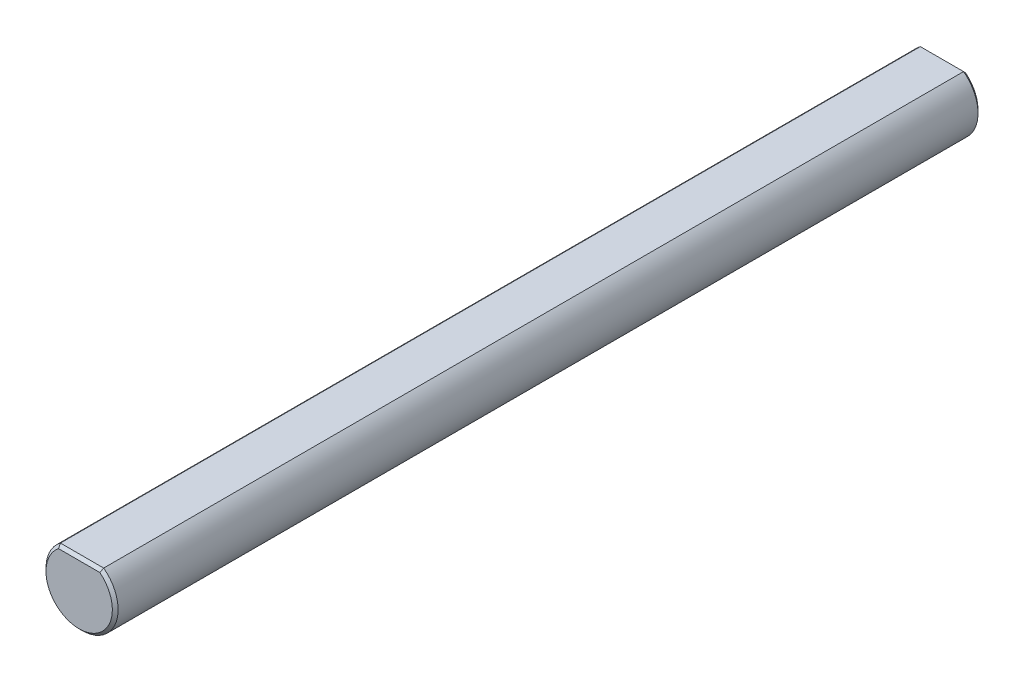
ISO-10303-21;
HEADER;
FILE_DESCRIPTION(('STEP AP214'),'2;1');
FILE_NAME('part.step','',(''),(''),'','','');
FILE_SCHEMA(('AUTOMOTIVE_DESIGN { 1 0 10303 214 1 1 1 1 }'));
ENDSEC;
DATA;
#1=APPLICATION_CONTEXT('core data for automotive mechanical design processes');
#2=APPLICATION_PROTOCOL_DEFINITION('international standard','automotive_design',2000,#1);
#3=PRODUCT_CONTEXT('',#1,'mechanical');
#4=PRODUCT('Part','Part','',(#3));
#5=PRODUCT_RELATED_PRODUCT_CATEGORY('part','',(#4));
#6=PRODUCT_DEFINITION_FORMATION('','',#4);
#7=PRODUCT_DEFINITION_CONTEXT('part definition',#1,'design');
#8=PRODUCT_DEFINITION('design','',#6,#7);
#9=PRODUCT_DEFINITION_SHAPE('','',#8);
#10=(LENGTH_UNIT() NAMED_UNIT(*) SI_UNIT(.MILLI.,.METRE.));
#11=(NAMED_UNIT(*) PLANE_ANGLE_UNIT() SI_UNIT($,.RADIAN.));
#12=(NAMED_UNIT(*) SI_UNIT($,.STERADIAN.) SOLID_ANGLE_UNIT());
#13=UNCERTAINTY_MEASURE_WITH_UNIT(LENGTH_MEASURE(1.E-05),#10,'distance_accuracy_value','');
#14=(GEOMETRIC_REPRESENTATION_CONTEXT(3) GLOBAL_UNCERTAINTY_ASSIGNED_CONTEXT((#13)) GLOBAL_UNIT_ASSIGNED_CONTEXT((#10,
#11,#12)) REPRESENTATION_CONTEXT('',''));
#15=CARTESIAN_POINT('',(0.,0.,0.));
#16=DIRECTION('',(0.,0.,1.));
#17=DIRECTION('',(1.,0.,0.));
#18=AXIS2_PLACEMENT_3D('',#15,#16,#17);
#19=CARTESIAN_POINT('',(0.,0.,38.1));
#20=DIRECTION('',(0.,0.,-1.));
#21=DIRECTION('',(-1.,0.,0.));
#22=AXIS2_PLACEMENT_3D('',#19,#20,#21);
#23=CYLINDRICAL_SURFACE('',#22,3.175);
#24=DIRECTION('',(0.,0.,-1.));
#25=VECTOR('',#24,1.);
#26=CARTESIAN_POINT('',(1.905,2.54,38.1));
#27=LINE('',#26,#25);
#28=CARTESIAN_POINT('',(1.905,2.54,37.846));
#29=VERTEX_POINT('',#28);
#30=CARTESIAN_POINT('',(1.905,2.54,-37.8459999999999));
#31=VERTEX_POINT('',#30);
#32=EDGE_CURVE('E96',#29,#31,#27,.T.);
#33=ORIENTED_EDGE('',*,*,#32,.F.);
#34=CARTESIAN_POINT('',(0.,0.,37.846));
#35=DIRECTION('',(0.,0.,1.));
#36=DIRECTION('',(1.,0.,0.));
#37=AXIS2_PLACEMENT_3D('',#34,#35,#36);
#38=CIRCLE('',#37,3.175);
#39=CARTESIAN_POINT('',(-1.905,2.54,37.846));
#40=VERTEX_POINT('',#39);
#41=EDGE_CURVE('E108',#29,#40,#38,.F.);
#42=ORIENTED_EDGE('',*,*,#41,.T.);
#43=DIRECTION('',(0.,0.,-1.));
#44=VECTOR('',#43,1.);
#45=CARTESIAN_POINT('',(-1.905,2.54,38.1));
#46=LINE('',#45,#44);
#47=CARTESIAN_POINT('',(-1.905,2.54,-37.8459999999999));
#48=VERTEX_POINT('',#47);
#49=EDGE_CURVE('E145',#40,#48,#46,.T.);
#50=ORIENTED_EDGE('',*,*,#49,.T.);
#51=CARTESIAN_POINT('',(0.,0.,-37.8459999999999));
#52=DIRECTION('',(0.,0.,1.));
#53=DIRECTION('',(1.,0.,0.));
#54=AXIS2_PLACEMENT_3D('',#51,#52,#53);
#55=CIRCLE('',#54,3.175);
#56=EDGE_CURVE('E106',#48,#31,#55,.T.);
#57=ORIENTED_EDGE('',*,*,#56,.T.);
#58=EDGE_LOOP('',(#33,#42,#50,#57));
#59=FACE_BOUND('',#58,.T.);
#60=ADVANCED_FACE('F34',(#59),#23,.T.);
#61=CARTESIAN_POINT('',(1.905,2.54,38.1));
#62=DIRECTION('',(0.,-1.,0.));
#63=DIRECTION('',(0.,0.,-1.));
#64=AXIS2_PLACEMENT_3D('',#61,#62,#63);
#65=PLANE('',#64);
#66=ORIENTED_EDGE('',*,*,#49,.F.);
#67=DIRECTION('',(1.,0.,0.));
#68=VECTOR('',#67,1.);
#69=CARTESIAN_POINT('',(1.905,2.54,37.846));
#70=LINE('',#69,#68);
#71=EDGE_CURVE('E87',#40,#29,#70,.T.);
#72=ORIENTED_EDGE('',*,*,#71,.T.);
#73=ORIENTED_EDGE('',*,*,#32,.T.);
#74=DIRECTION('',(-1.,0.,0.));
#75=VECTOR('',#74,1.);
#76=CARTESIAN_POINT('',(1.905,2.54,-37.8459999999999));
#77=LINE('',#76,#75);
#78=EDGE_CURVE('E99',#31,#48,#77,.T.);
#79=ORIENTED_EDGE('',*,*,#78,.T.);
#80=EDGE_LOOP('',(#66,#72,#73,#79));
#81=FACE_BOUND('',#80,.T.);
#82=ADVANCED_FACE('F144',(#81),#65,.F.);
#83=CARTESIAN_POINT('',(0.,0.,38.1));
#84=DIRECTION('',(0.,0.,1.));
#85=DIRECTION('',(1.,0.,0.));
#86=AXIS2_PLACEMENT_3D('',#83,#84,#85);
#87=PLANE('',#86);
#88=CARTESIAN_POINT('',(0.,0.,38.1));
#89=DIRECTION('',(0.,0.,1.));
#90=DIRECTION('',(1.,0.,0.));
#91=AXIS2_PLACEMENT_3D('',#88,#89,#90);
#92=CIRCLE('',#91,2.92100000000003);
#93=CARTESIAN_POINT('',(-1.81836327503615,2.286,38.1));
#94=VERTEX_POINT('',#93);
#95=CARTESIAN_POINT('',(1.81836327503615,2.286,38.1));
#96=VERTEX_POINT('',#95);
#97=EDGE_CURVE('E93',#94,#96,#92,.T.);
#98=ORIENTED_EDGE('',*,*,#97,.T.);
#99=DIRECTION('',(-1.,0.,0.));
#100=VECTOR('',#99,1.);
#101=CARTESIAN_POINT('',(-1.905,2.28600000000003,38.1));
#102=LINE('',#101,#100);
#103=EDGE_CURVE('E85',#96,#94,#102,.T.);
#104=ORIENTED_EDGE('',*,*,#103,.T.);
#105=EDGE_LOOP('',(#98,#104));
#106=FACE_BOUND('',#105,.T.);
#107=ADVANCED_FACE('F98',(#106),#87,.T.);
#108=CARTESIAN_POINT('',(0.,0.,-38.1));
#109=DIRECTION('',(0.,0.,1.));
#110=DIRECTION('',(1.,0.,0.));
#111=AXIS2_PLACEMENT_3D('',#108,#109,#110);
#112=PLANE('',#111);
#113=CARTESIAN_POINT('',(0.,0.,-38.1));
#114=DIRECTION('',(0.,0.,1.));
#115=DIRECTION('',(1.,0.,0.));
#116=AXIS2_PLACEMENT_3D('',#113,#114,#115);
#117=CIRCLE('',#116,2.92099999999994);
#118=CARTESIAN_POINT('',(1.81836327503612,2.2859999999999,-38.1));
#119=VERTEX_POINT('',#118);
#120=CARTESIAN_POINT('',(-1.81836327503612,2.2859999999999,-38.1));
#121=VERTEX_POINT('',#120);
#122=EDGE_CURVE('E48',#119,#121,#117,.F.);
#123=ORIENTED_EDGE('',*,*,#122,.T.);
#124=DIRECTION('',(1.,0.,0.));
#125=VECTOR('',#124,1.);
#126=CARTESIAN_POINT('',(0.,2.28599999999994,-38.1));
#127=LINE('',#126,#125);
#128=EDGE_CURVE('E11',#121,#119,#127,.T.);
#129=ORIENTED_EDGE('',*,*,#128,.T.);
#130=EDGE_LOOP('',(#123,#129));
#131=FACE_BOUND('',#130,.T.);
#132=ADVANCED_FACE('F153',(#131),#112,.F.);
#133=CARTESIAN_POINT('',(0.,0.,38.1));
#134=DIRECTION('',(0.,0.,-1.));
#135=DIRECTION('',(-1.,0.,0.));
#136=AXIS2_PLACEMENT_3D('',#133,#134,#135);
#137=CONICAL_SURFACE('',#136,2.92100000000003,0.785398163397454);
#138=CARTESIAN_POINT('',(-1.81836327503618,2.28600000000003,38.1));
#139=CARTESIAN_POINT('',(-1.83312020816111,2.32827920209278,38.0577207979073));
#140=CARTESIAN_POINT('',(-1.84771840387271,2.3705854760154,38.0154145239846));
#141=CARTESIAN_POINT('',(-1.87659731200799,2.45525214271378,37.9307478572863));
#142=CARTESIAN_POINT('',(-1.8908780246177,2.49761253545781,37.8883874645422));
#143=CARTESIAN_POINT('',(-1.90500000000012,2.53999999999998,37.8460000000001));
#144=B_SPLINE_CURVE_WITH_KNOTS('',3,(#138,#139,#140,#141,#142,#143),.UNSPECIFIED.,.F.,.F.,(4,2,
4),(0.,0.184755894358444,0.369511680453177),.UNSPECIFIED.);
#145=EDGE_CURVE('E81',#40,#94,#144,.F.);
#146=ORIENTED_EDGE('',*,*,#145,.F.);
#147=ORIENTED_EDGE('',*,*,#41,.F.);
#148=CARTESIAN_POINT('',(1.905,2.54,37.846));
#149=CARTESIAN_POINT('',(1.89087802461764,2.49761253545782,37.8883874645422));
#150=CARTESIAN_POINT('',(1.87659731200797,2.45525214271378,37.9307478572862));
#151=CARTESIAN_POINT('',(1.84771840387274,2.3705854760154,38.0154145239846));
#152=CARTESIAN_POINT('',(1.83312020816115,2.32827920209278,38.0577207979073));
#153=CARTESIAN_POINT('',(1.81836327503622,2.28600000000003,38.1));
#154=B_SPLINE_CURVE_WITH_KNOTS('',3,(#148,#149,#150,#151,#152,#153),.UNSPECIFIED.,.F.,.F.,(4,2,
4),(0.,0.184755786094727,0.369511680453178),.UNSPECIFIED.);
#155=EDGE_CURVE('E90',#96,#29,#154,.F.);
#156=ORIENTED_EDGE('',*,*,#155,.F.);
#157=ORIENTED_EDGE('',*,*,#97,.F.);
#158=EDGE_LOOP('',(#146,#147,#156,#157));
#159=FACE_BOUND('',#158,.T.);
#160=ADVANCED_FACE('F94',(#159),#137,.T.);
#161=CARTESIAN_POINT('',(0.,2.28600000000003,38.1));
#162=DIRECTION('',(0.,0.707106781186543,0.707106781186552));
#163=DIRECTION('',(1.,0.,0.));
#164=AXIS2_PLACEMENT_3D('',#161,#162,#163);
#165=PLANE('',#164);
#166=ORIENTED_EDGE('',*,*,#155,.T.);
#167=ORIENTED_EDGE('',*,*,#71,.F.);
#168=ORIENTED_EDGE('',*,*,#145,.T.);
#169=ORIENTED_EDGE('',*,*,#103,.F.);
#170=EDGE_LOOP('',(#166,#167,#168,#169));
#171=FACE_BOUND('',#170,.T.);
#172=ADVANCED_FACE('F83',(#171),#165,.T.);
#173=CARTESIAN_POINT('',(0.,0.,-37.8459999999999));
#174=DIRECTION('',(0.,0.,1.));
#175=DIRECTION('',(1.,0.,0.));
#176=AXIS2_PLACEMENT_3D('',#173,#174,#175);
#177=CONICAL_SURFACE('',#176,3.175,0.785398163397454);
#178=CARTESIAN_POINT('',(-1.905,2.54,-37.8459999999999));
#179=CARTESIAN_POINT('',(-1.89087802461763,2.4976125354578,-37.8883874645421));
#180=CARTESIAN_POINT('',(-1.87659731200796,2.45525214271375,-37.9307478572862));
#181=CARTESIAN_POINT('',(-1.84771840387272,2.37058547601533,-38.0154145239846));
#182=CARTESIAN_POINT('',(-1.83312020816112,2.3282792020927,-38.0577207979072));
#183=CARTESIAN_POINT('',(-1.81836327503618,2.28599999999993,-38.1));
#184=B_SPLINE_CURVE_WITH_KNOTS('',3,(#178,#179,#180,#181,#182,#183),.UNSPECIFIED.,.F.,.F.,(4,2,
4),(0.,0.184755786094804,0.369511680453319),.UNSPECIFIED.);
#185=EDGE_CURVE('E131',#121,#48,#184,.F.);
#186=ORIENTED_EDGE('',*,*,#185,.F.);
#187=ORIENTED_EDGE('',*,*,#122,.F.);
#188=CARTESIAN_POINT('',(1.81836327503615,2.28599999999994,-38.1));
#189=CARTESIAN_POINT('',(1.83312020816108,2.3282792020927,-38.0577207979072));
#190=CARTESIAN_POINT('',(1.84771840387269,2.37058547601534,-38.0154145239846));
#191=CARTESIAN_POINT('',(1.87659731200798,2.45525214271375,-37.9307478572862));
#192=CARTESIAN_POINT('',(1.8908780246177,2.49761253545779,-37.8883874645421));
#193=CARTESIAN_POINT('',(1.90500000000012,2.53999999999998,-37.846));
#194=B_SPLINE_CURVE_WITH_KNOTS('',3,(#188,#189,#190,#191,#192,#193),.UNSPECIFIED.,.F.,.F.,(4,2,
4),(0.,0.184755894358521,0.369511680453318),.UNSPECIFIED.);
#195=EDGE_CURVE('E39',#31,#119,#194,.F.);
#196=ORIENTED_EDGE('',*,*,#195,.F.);
#197=ORIENTED_EDGE('',*,*,#56,.F.);
#198=EDGE_LOOP('',(#186,#187,#196,#197));
#199=FACE_BOUND('',#198,.T.);
#200=ADVANCED_FACE('F125',(#199),#177,.T.);
#201=CARTESIAN_POINT('',(1.905,2.54,-37.8459999999999));
#202=DIRECTION('',(0.,-0.707106781186543,0.707106781186552));
#203=DIRECTION('',(-1.,0.,0.));
#204=AXIS2_PLACEMENT_3D('',#201,#202,#203);
#205=PLANE('',#204);
#206=ORIENTED_EDGE('',*,*,#195,.T.);
#207=ORIENTED_EDGE('',*,*,#128,.F.);
#208=ORIENTED_EDGE('',*,*,#185,.T.);
#209=ORIENTED_EDGE('',*,*,#78,.F.);
#210=EDGE_LOOP('',(#206,#207,#208,#209));
#211=FACE_BOUND('',#210,.T.);
#212=ADVANCED_FACE('F36',(#211),#205,.F.);
#213=CLOSED_SHELL('',(#60,#82,#107,#132,#160,#172,#200,#212));
#214=MANIFOLD_SOLID_BREP('B2',#213);
#215=ADVANCED_BREP_SHAPE_REPRESENTATION('',(#18,#214),#14);
#216=SHAPE_DEFINITION_REPRESENTATION(#9,#215);
ENDSEC;
END-ISO-10303-21;
